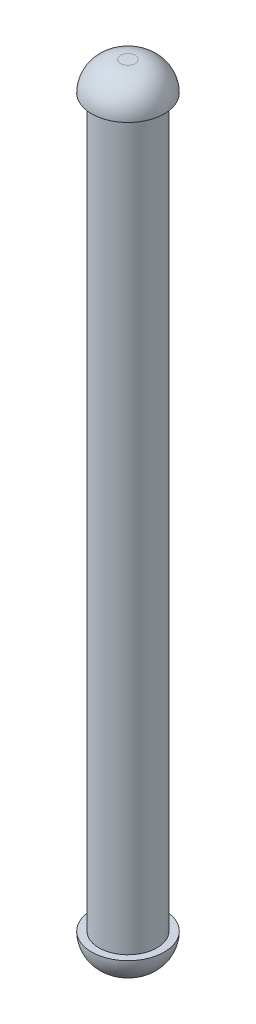
ISO-10303-21;
HEADER;
FILE_DESCRIPTION(('STEP AP214'),'2;1');
FILE_NAME('part.step','',(''),(''),'','','');
FILE_SCHEMA(('AUTOMOTIVE_DESIGN { 1 0 10303 214 1 1 1 1 }'));
ENDSEC;
DATA;
#1=APPLICATION_CONTEXT('core data for automotive mechanical design processes');
#2=APPLICATION_PROTOCOL_DEFINITION('international standard','automotive_design',2000,#1);
#3=PRODUCT_CONTEXT('',#1,'mechanical');
#4=PRODUCT('Part','Part','',(#3));
#5=PRODUCT_RELATED_PRODUCT_CATEGORY('part','',(#4));
#6=PRODUCT_DEFINITION_FORMATION('','',#4);
#7=PRODUCT_DEFINITION_CONTEXT('part definition',#1,'design');
#8=PRODUCT_DEFINITION('design','',#6,#7);
#9=PRODUCT_DEFINITION_SHAPE('','',#8);
#10=(LENGTH_UNIT() NAMED_UNIT(*) SI_UNIT(.MILLI.,.METRE.));
#11=(NAMED_UNIT(*) PLANE_ANGLE_UNIT() SI_UNIT($,.RADIAN.));
#12=(NAMED_UNIT(*) SI_UNIT($,.STERADIAN.) SOLID_ANGLE_UNIT());
#13=UNCERTAINTY_MEASURE_WITH_UNIT(LENGTH_MEASURE(1.E-05),#10,'distance_accuracy_value','');
#14=(GEOMETRIC_REPRESENTATION_CONTEXT(3) GLOBAL_UNCERTAINTY_ASSIGNED_CONTEXT((#13)) GLOBAL_UNIT_ASSIGNED_CONTEXT((#10,
#11,#12)) REPRESENTATION_CONTEXT('',''));
#15=CARTESIAN_POINT('',(0.,0.,0.));
#16=DIRECTION('',(0.,0.,1.));
#17=DIRECTION('',(1.,0.,0.));
#18=AXIS2_PLACEMENT_3D('',#15,#16,#17);
#19=CARTESIAN_POINT('',(0.,25.,0.));
#20=DIRECTION('',(0.,-1.,0.));
#21=DIRECTION('',(0.,0.,-1.));
#22=AXIS2_PLACEMENT_3D('',#19,#20,#21);
#23=CYLINDRICAL_SURFACE('',#22,1.);
#24=CARTESIAN_POINT('',(0.,25.,0.));
#25=DIRECTION('',(0.,1.,0.));
#26=DIRECTION('',(0.,0.,1.));
#27=AXIS2_PLACEMENT_3D('',#24,#25,#26);
#28=CIRCLE('',#27,1.);
#29=CARTESIAN_POINT('',(0.,25.,1.));
#30=VERTEX_POINT('',#29);
#31=EDGE_CURVE('E41',#30,#30,#28,.T.);
#32=ORIENTED_EDGE('',*,*,#31,.F.);
#33=EDGE_LOOP('',(#32));
#34=FACE_BOUND('',#33,.T.);
#35=CARTESIAN_POINT('',(0.,0.,0.));
#36=DIRECTION('',(0.,1.,0.));
#37=DIRECTION('',(0.,0.,1.));
#38=AXIS2_PLACEMENT_3D('',#35,#36,#37);
#39=CIRCLE('',#38,1.);
#40=CARTESIAN_POINT('',(0.,0.,1.));
#41=VERTEX_POINT('',#40);
#42=EDGE_CURVE('E45',#41,#41,#39,.T.);
#43=ORIENTED_EDGE('',*,*,#42,.T.);
#44=EDGE_LOOP('',(#43));
#45=FACE_BOUND('',#44,.T.);
#46=ADVANCED_FACE('F30',(#34,#45),#23,.T.);
#47=CARTESIAN_POINT('',(0.,-1.,0.));
#48=DIRECTION('',(0.,1.,0.));
#49=DIRECTION('',(0.,0.,1.));
#50=AXIS2_PLACEMENT_3D('',#47,#48,#49);
#51=PLANE('',#50);
#52=CARTESIAN_POINT('',(0.,-1.,0.));
#53=DIRECTION('',(0.,1.,0.));
#54=DIRECTION('',(0.,0.,1.));
#55=AXIS2_PLACEMENT_3D('',#52,#53,#54);
#56=CIRCLE('',#55,0.25);
#57=CARTESIAN_POINT('',(0.,-1.,0.25));
#58=VERTEX_POINT('',#57);
#59=EDGE_CURVE('E37',#58,#58,#56,.F.);
#60=ORIENTED_EDGE('',*,*,#59,.T.);
#61=EDGE_LOOP('',(#60));
#62=FACE_BOUND('',#61,.T.);
#63=ADVANCED_FACE('F72',(#62),#51,.F.);
#64=CARTESIAN_POINT('',(0.,0.,0.));
#65=DIRECTION('',(0.,1.,0.));
#66=DIRECTION('',(0.,0.,1.));
#67=AXIS2_PLACEMENT_3D('',#64,#65,#66);
#68=PLANE('',#67);
#69=ORIENTED_EDGE('',*,*,#42,.F.);
#70=EDGE_LOOP('',(#69));
#71=FACE_BOUND('',#70,.T.);
#72=CARTESIAN_POINT('',(0.,0.,0.));
#73=DIRECTION('',(0.,1.,0.));
#74=DIRECTION('',(0.,0.,1.));
#75=AXIS2_PLACEMENT_3D('',#72,#73,#74);
#76=CIRCLE('',#75,1.25);
#77=CARTESIAN_POINT('',(0.,0.,1.25));
#78=VERTEX_POINT('',#77);
#79=EDGE_CURVE('E50',#78,#78,#76,.T.);
#80=ORIENTED_EDGE('',*,*,#79,.T.);
#81=EDGE_LOOP('',(#80));
#82=FACE_BOUND('',#81,.T.);
#83=ADVANCED_FACE('F78',(#71,#82),#68,.T.);
#84=CARTESIAN_POINT('',(0.,0.,0.));
#85=DIRECTION('',(0.,1.,0.));
#86=DIRECTION('',(0.,0.,1.));
#87=AXIS2_PLACEMENT_3D('',#84,#85,#86);
#88=DEGENERATE_TOROIDAL_SURFACE('',#87,0.25,1.,.T.);
#89=ORIENTED_EDGE('',*,*,#59,.F.);
#90=EDGE_LOOP('',(#89));
#91=FACE_BOUND('',#90,.T.);
#92=ORIENTED_EDGE('',*,*,#79,.F.);
#93=EDGE_LOOP('',(#92));
#94=FACE_BOUND('',#93,.T.);
#95=ADVANCED_FACE('F68',(#91,#94),#88,.T.);
#96=CARTESIAN_POINT('',(0.,26.,0.));
#97=DIRECTION('',(0.,1.,0.));
#98=DIRECTION('',(0.,0.,1.));
#99=AXIS2_PLACEMENT_3D('',#96,#97,#98);
#100=PLANE('',#99);
#101=CARTESIAN_POINT('',(0.,26.,0.));
#102=DIRECTION('',(0.,1.,0.));
#103=DIRECTION('',(0.,0.,1.));
#104=AXIS2_PLACEMENT_3D('',#101,#102,#103);
#105=CIRCLE('',#104,0.25);
#106=CARTESIAN_POINT('',(0.,26.,0.25));
#107=VERTEX_POINT('',#106);
#108=EDGE_CURVE('E10',#107,#107,#105,.T.);
#109=ORIENTED_EDGE('',*,*,#108,.T.);
#110=EDGE_LOOP('',(#109));
#111=FACE_BOUND('',#110,.T.);
#112=ADVANCED_FACE('F61',(#111),#100,.T.);
#113=CARTESIAN_POINT('',(0.,25.,0.));
#114=DIRECTION('',(0.,1.,0.));
#115=DIRECTION('',(0.,0.,1.));
#116=AXIS2_PLACEMENT_3D('',#113,#114,#115);
#117=PLANE('',#116);
#118=ORIENTED_EDGE('',*,*,#31,.T.);
#119=EDGE_LOOP('',(#118));
#120=FACE_BOUND('',#119,.T.);
#121=CARTESIAN_POINT('',(0.,25.,0.));
#122=DIRECTION('',(0.,1.,0.));
#123=DIRECTION('',(0.,0.,1.));
#124=AXIS2_PLACEMENT_3D('',#121,#122,#123);
#125=CIRCLE('',#124,1.25);
#126=CARTESIAN_POINT('',(0.,25.,1.25));
#127=VERTEX_POINT('',#126);
#128=EDGE_CURVE('E53',#127,#127,#125,.T.);
#129=ORIENTED_EDGE('',*,*,#128,.F.);
#130=EDGE_LOOP('',(#129));
#131=FACE_BOUND('',#130,.T.);
#132=ADVANCED_FACE('F59',(#120,#131),#117,.F.);
#133=CARTESIAN_POINT('',(0.,25.,0.));
#134=DIRECTION('',(0.,1.,0.));
#135=DIRECTION('',(0.,0.,1.));
#136=AXIS2_PLACEMENT_3D('',#133,#134,#135);
#137=DEGENERATE_TOROIDAL_SURFACE('',#136,0.25,1.,.T.);
#138=ORIENTED_EDGE('',*,*,#128,.T.);
#139=EDGE_LOOP('',(#138));
#140=FACE_BOUND('',#139,.T.);
#141=ORIENTED_EDGE('',*,*,#108,.F.);
#142=EDGE_LOOP('',(#141));
#143=FACE_BOUND('',#142,.T.);
#144=ADVANCED_FACE('F32',(#140,#143),#137,.T.);
#145=CLOSED_SHELL('',(#46,#63,#83,#95,#112,#132,#144));
#146=MANIFOLD_SOLID_BREP('B2',#145);
#147=ADVANCED_BREP_SHAPE_REPRESENTATION('',(#18,#146),#14);
#148=SHAPE_DEFINITION_REPRESENTATION(#9,#147);
ENDSEC;
END-ISO-10303-21;
